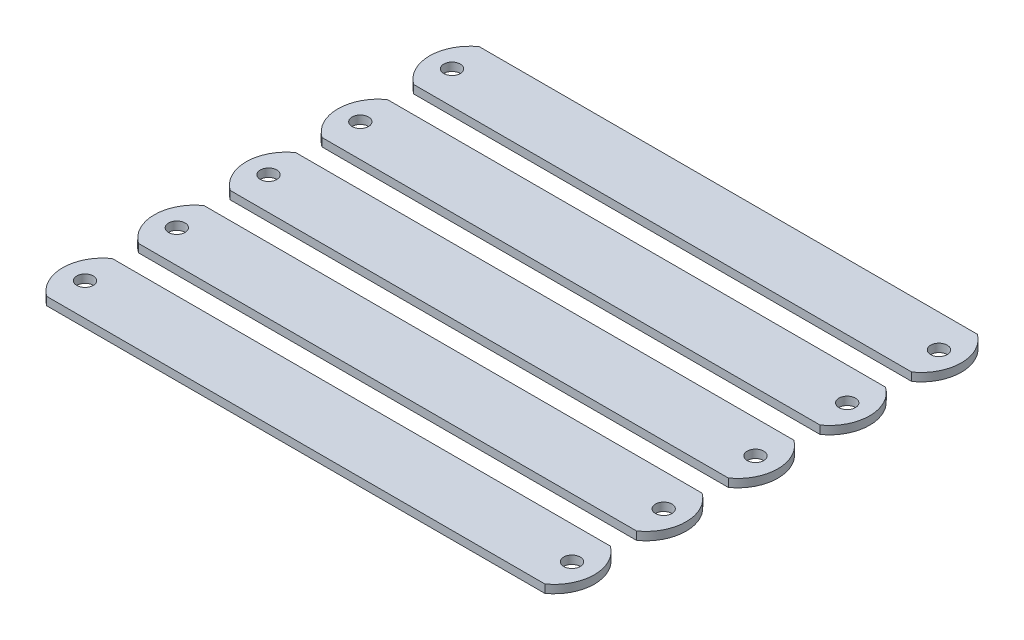
ISO-10303-21;
HEADER;
FILE_DESCRIPTION(('STEP AP214'),'2;1');
FILE_NAME('part.step','',(''),(''),'','','');
FILE_SCHEMA(('AUTOMOTIVE_DESIGN { 1 0 10303 214 1 1 1 1 }'));
ENDSEC;
DATA;
#1=APPLICATION_CONTEXT('core data for automotive mechanical design processes');
#2=APPLICATION_PROTOCOL_DEFINITION('international standard','automotive_design',2000,#1);
#3=PRODUCT_CONTEXT('',#1,'mechanical');
#4=PRODUCT('Part','Part','',(#3));
#5=PRODUCT_RELATED_PRODUCT_CATEGORY('part','',(#4));
#6=PRODUCT_DEFINITION_FORMATION('','',#4);
#7=PRODUCT_DEFINITION_CONTEXT('part definition',#1,'design');
#8=PRODUCT_DEFINITION('design','',#6,#7);
#9=PRODUCT_DEFINITION_SHAPE('','',#8);
#10=(LENGTH_UNIT() NAMED_UNIT(*) SI_UNIT(.MILLI.,.METRE.));
#11=(NAMED_UNIT(*) PLANE_ANGLE_UNIT() SI_UNIT($,.RADIAN.));
#12=(NAMED_UNIT(*) SI_UNIT($,.STERADIAN.) SOLID_ANGLE_UNIT());
#13=UNCERTAINTY_MEASURE_WITH_UNIT(LENGTH_MEASURE(1.E-05),#10,'distance_accuracy_value','');
#14=(GEOMETRIC_REPRESENTATION_CONTEXT(3) GLOBAL_UNCERTAINTY_ASSIGNED_CONTEXT((#13)) GLOBAL_UNIT_ASSIGNED_CONTEXT((#10,
#11,#12)) REPRESENTATION_CONTEXT('',''));
#15=CARTESIAN_POINT('',(0.,0.,0.));
#16=DIRECTION('',(0.,0.,1.));
#17=DIRECTION('',(1.,0.,0.));
#18=AXIS2_PLACEMENT_3D('',#15,#16,#17);
#19=CARTESIAN_POINT('',(0.,0.79375,-77.47));
#20=DIRECTION('',(0.,0.,-1.));
#21=DIRECTION('',(-1.,0.,0.));
#22=AXIS2_PLACEMENT_3D('',#19,#20,#21);
#23=PLANE('',#22);
#24=DIRECTION('',(1.,0.,0.));
#25=VECTOR('',#24,1.);
#26=CARTESIAN_POINT('',(0.,-0.79375,-77.47));
#27=LINE('',#26,#25);
#28=CARTESIAN_POINT('',(-48.26,-0.79375,-77.47));
#29=VERTEX_POINT('',#28);
#30=CARTESIAN_POINT('',(48.26,-0.79375,-77.47));
#31=VERTEX_POINT('',#30);
#32=EDGE_CURVE('E119',#29,#31,#27,.T.);
#33=ORIENTED_EDGE('',*,*,#32,.F.);
#34=DIRECTION('',(0.,-1.,0.));
#35=VECTOR('',#34,1.);
#36=CARTESIAN_POINT('',(-48.26,0.79375,-77.47));
#37=LINE('',#36,#35);
#38=CARTESIAN_POINT('',(-48.26,0.79375,-77.47));
#39=VERTEX_POINT('',#38);
#40=EDGE_CURVE('E12',#39,#29,#37,.T.);
#41=ORIENTED_EDGE('',*,*,#40,.F.);
#42=DIRECTION('',(1.,0.,0.));
#43=VECTOR('',#42,1.);
#44=CARTESIAN_POINT('',(0.,0.79375,-77.47));
#45=LINE('',#44,#43);
#46=CARTESIAN_POINT('',(48.26,0.79375,-77.47));
#47=VERTEX_POINT('',#46);
#48=EDGE_CURVE('E106',#39,#47,#45,.T.);
#49=ORIENTED_EDGE('',*,*,#48,.T.);
#50=DIRECTION('',(0.,-1.,0.));
#51=VECTOR('',#50,1.);
#52=CARTESIAN_POINT('',(48.26,0.79375,-77.47));
#53=LINE('',#52,#51);
#54=EDGE_CURVE('E63',#47,#31,#53,.T.);
#55=ORIENTED_EDGE('',*,*,#54,.T.);
#56=EDGE_LOOP('',(#33,#41,#49,#55));
#57=FACE_BOUND('',#56,.T.);
#58=ADVANCED_FACE('F46',(#57),#23,.T.);
#59=CARTESIAN_POINT('',(-43.7294932689875,0.79375,-71.12));
#60=DIRECTION('',(0.,-1.,0.));
#61=DIRECTION('',(0.,0.,-1.));
#62=AXIS2_PLACEMENT_3D('',#59,#60,#61);
#63=CYLINDRICAL_SURFACE('',#62,7.80051224213831);
#64=CARTESIAN_POINT('',(-43.7294932689875,-0.79375,-71.12));
#65=DIRECTION('',(0.,1.,0.));
#66=DIRECTION('',(0.,0.,1.));
#67=AXIS2_PLACEMENT_3D('',#64,#65,#66);
#68=CIRCLE('',#67,7.80051224213831);
#69=CARTESIAN_POINT('',(-48.26,-0.79375,-64.77));
#70=VERTEX_POINT('',#69);
#71=EDGE_CURVE('E95',#70,#29,#68,.F.);
#72=ORIENTED_EDGE('',*,*,#71,.F.);
#73=DIRECTION('',(0.,-1.,0.));
#74=VECTOR('',#73,1.);
#75=CARTESIAN_POINT('',(-48.26,0.79375,-64.77));
#76=LINE('',#75,#74);
#77=CARTESIAN_POINT('',(-48.26,0.79375,-64.77));
#78=VERTEX_POINT('',#77);
#79=EDGE_CURVE('E55',#78,#70,#76,.T.);
#80=ORIENTED_EDGE('',*,*,#79,.F.);
#81=CARTESIAN_POINT('',(-43.7294932689875,0.79375,-71.12));
#82=DIRECTION('',(0.,1.,0.));
#83=DIRECTION('',(0.,0.,1.));
#84=AXIS2_PLACEMENT_3D('',#81,#82,#83);
#85=CIRCLE('',#84,7.80051224213831);
#86=EDGE_CURVE('E93',#78,#39,#85,.F.);
#87=ORIENTED_EDGE('',*,*,#86,.T.);
#88=ORIENTED_EDGE('',*,*,#40,.T.);
#89=EDGE_LOOP('',(#72,#80,#87,#88));
#90=FACE_BOUND('',#89,.T.);
#91=ADVANCED_FACE('F91',(#90),#63,.T.);
#92=CARTESIAN_POINT('',(0.,0.79375,-64.77));
#93=DIRECTION('',(0.,0.,-1.));
#94=DIRECTION('',(-1.,0.,0.));
#95=AXIS2_PLACEMENT_3D('',#92,#93,#94);
#96=PLANE('',#95);
#97=DIRECTION('',(1.,0.,0.));
#98=VECTOR('',#97,1.);
#99=CARTESIAN_POINT('',(0.,-0.79375,-64.77));
#100=LINE('',#99,#98);
#101=CARTESIAN_POINT('',(48.26,-0.79375,-64.77));
#102=VERTEX_POINT('',#101);
#103=EDGE_CURVE('E122',#70,#102,#100,.T.);
#104=ORIENTED_EDGE('',*,*,#103,.T.);
#105=DIRECTION('',(0.,-1.,0.));
#106=VECTOR('',#105,1.);
#107=CARTESIAN_POINT('',(48.26,0.79375,-64.77));
#108=LINE('',#107,#106);
#109=CARTESIAN_POINT('',(48.26,0.79375,-64.77));
#110=VERTEX_POINT('',#109);
#111=EDGE_CURVE('E77',#110,#102,#108,.T.);
#112=ORIENTED_EDGE('',*,*,#111,.F.);
#113=DIRECTION('',(1.,0.,0.));
#114=VECTOR('',#113,1.);
#115=CARTESIAN_POINT('',(0.,0.79375,-64.77));
#116=LINE('',#115,#114);
#117=EDGE_CURVE('E98',#78,#110,#116,.T.);
#118=ORIENTED_EDGE('',*,*,#117,.F.);
#119=ORIENTED_EDGE('',*,*,#79,.T.);
#120=EDGE_LOOP('',(#104,#112,#118,#119));
#121=FACE_BOUND('',#120,.T.);
#122=ADVANCED_FACE('F99',(#121),#96,.F.);
#123=CARTESIAN_POINT('',(43.7294933208789,0.79375,-71.12));
#124=DIRECTION('',(0.,-1.,0.));
#125=DIRECTION('',(0.,0.,-1.));
#126=AXIS2_PLACEMENT_3D('',#123,#124,#125);
#127=CYLINDRICAL_SURFACE('',#126,7.800512212);
#128=CARTESIAN_POINT('',(43.7294933208789,-0.79375,-71.12));
#129=DIRECTION('',(0.,1.,0.));
#130=DIRECTION('',(0.,0.,1.));
#131=AXIS2_PLACEMENT_3D('',#128,#129,#130);
#132=CIRCLE('',#131,7.800512212);
#133=EDGE_CURVE('E124',#31,#102,#132,.F.);
#134=ORIENTED_EDGE('',*,*,#133,.F.);
#135=ORIENTED_EDGE('',*,*,#54,.F.);
#136=CARTESIAN_POINT('',(43.7294933208789,0.79375,-71.12));
#137=DIRECTION('',(0.,1.,0.));
#138=DIRECTION('',(0.,0.,1.));
#139=AXIS2_PLACEMENT_3D('',#136,#137,#138);
#140=CIRCLE('',#139,7.800512212);
#141=EDGE_CURVE('E102',#47,#110,#140,.F.);
#142=ORIENTED_EDGE('',*,*,#141,.T.);
#143=ORIENTED_EDGE('',*,*,#111,.T.);
#144=EDGE_LOOP('',(#134,#135,#142,#143));
#145=FACE_BOUND('',#144,.T.);
#146=ADVANCED_FACE('F140',(#145),#127,.T.);
#147=CARTESIAN_POINT('',(47.177105685512,0.79375,-71.12));
#148=DIRECTION('',(0.,-1.,0.));
#149=DIRECTION('',(0.,0.,-1.));
#150=AXIS2_PLACEMENT_3D('',#147,#148,#149);
#151=CYLINDRICAL_SURFACE('',#150,1.6002);
#152=CARTESIAN_POINT('',(47.177105685512,0.79375,-71.12));
#153=DIRECTION('',(0.,1.,0.));
#154=DIRECTION('',(0.,0.,1.));
#155=AXIS2_PLACEMENT_3D('',#152,#153,#154);
#156=CIRCLE('',#155,1.6002);
#157=CARTESIAN_POINT('',(47.177105685512,0.79375,-69.5198));
#158=VERTEX_POINT('',#157);
#159=EDGE_CURVE('E108',#158,#158,#156,.F.);
#160=ORIENTED_EDGE('',*,*,#159,.F.);
#161=EDGE_LOOP('',(#160));
#162=FACE_BOUND('',#161,.T.);
#163=CARTESIAN_POINT('',(47.177105685512,-0.79375,-71.12));
#164=DIRECTION('',(0.,1.,0.));
#165=DIRECTION('',(0.,0.,1.));
#166=AXIS2_PLACEMENT_3D('',#163,#164,#165);
#167=CIRCLE('',#166,1.6002);
#168=CARTESIAN_POINT('',(47.177105685512,-0.79375,-69.5198));
#169=VERTEX_POINT('',#168);
#170=EDGE_CURVE('E116',#169,#169,#167,.F.);
#171=ORIENTED_EDGE('',*,*,#170,.T.);
#172=EDGE_LOOP('',(#171));
#173=FACE_BOUND('',#172,.T.);
#174=ADVANCED_FACE('F48',(#162,#173),#151,.F.);
#175=CARTESIAN_POINT('',(-47.177105685512,0.79375,-71.12));
#176=DIRECTION('',(0.,-1.,0.));
#177=DIRECTION('',(0.,0.,-1.));
#178=AXIS2_PLACEMENT_3D('',#175,#176,#177);
#179=CYLINDRICAL_SURFACE('',#178,1.6002);
#180=CARTESIAN_POINT('',(-47.177105685512,0.79375,-71.12));
#181=DIRECTION('',(0.,1.,0.));
#182=DIRECTION('',(0.,0.,1.));
#183=AXIS2_PLACEMENT_3D('',#180,#181,#182);
#184=CIRCLE('',#183,1.6002);
#185=CARTESIAN_POINT('',(-47.177105685512,0.79375,-69.5198));
#186=VERTEX_POINT('',#185);
#187=EDGE_CURVE('E113',#186,#186,#184,.T.);
#188=ORIENTED_EDGE('',*,*,#187,.T.);
#189=EDGE_LOOP('',(#188));
#190=FACE_BOUND('',#189,.T.);
#191=CARTESIAN_POINT('',(-47.177105685512,-0.79375,-71.12));
#192=DIRECTION('',(0.,1.,0.));
#193=DIRECTION('',(0.,0.,1.));
#194=AXIS2_PLACEMENT_3D('',#191,#192,#193);
#195=CIRCLE('',#194,1.6002);
#196=CARTESIAN_POINT('',(-47.177105685512,-0.79375,-69.5198));
#197=VERTEX_POINT('',#196);
#198=EDGE_CURVE('E127',#197,#197,#195,.T.);
#199=ORIENTED_EDGE('',*,*,#198,.F.);
#200=EDGE_LOOP('',(#199));
#201=FACE_BOUND('',#200,.T.);
#202=ADVANCED_FACE('F139',(#190,#201),#179,.F.);
#203=CARTESIAN_POINT('',(0.,0.79375,-71.12));
#204=DIRECTION('',(0.,1.,0.));
#205=DIRECTION('',(0.,0.,1.));
#206=AXIS2_PLACEMENT_3D('',#203,#204,#205);
#207=PLANE('',#206);
#208=ORIENTED_EDGE('',*,*,#159,.T.);
#209=EDGE_LOOP('',(#208));
#210=FACE_BOUND('',#209,.T.);
#211=ORIENTED_EDGE('',*,*,#48,.F.);
#212=ORIENTED_EDGE('',*,*,#86,.F.);
#213=ORIENTED_EDGE('',*,*,#117,.T.);
#214=ORIENTED_EDGE('',*,*,#141,.F.);
#215=EDGE_LOOP('',(#211,#212,#213,#214));
#216=FACE_BOUND('',#215,.T.);
#217=ORIENTED_EDGE('',*,*,#187,.F.);
#218=EDGE_LOOP('',(#217));
#219=FACE_BOUND('',#218,.T.);
#220=ADVANCED_FACE('F104',(#210,#216,#219),#207,.T.);
#221=CARTESIAN_POINT('',(0.,-0.79375,-71.12));
#222=DIRECTION('',(0.,1.,0.));
#223=DIRECTION('',(0.,0.,1.));
#224=AXIS2_PLACEMENT_3D('',#221,#222,#223);
#225=PLANE('',#224);
#226=ORIENTED_EDGE('',*,*,#170,.F.);
#227=EDGE_LOOP('',(#226));
#228=FACE_BOUND('',#227,.T.);
#229=ORIENTED_EDGE('',*,*,#32,.T.);
#230=ORIENTED_EDGE('',*,*,#133,.T.);
#231=ORIENTED_EDGE('',*,*,#103,.F.);
#232=ORIENTED_EDGE('',*,*,#71,.T.);
#233=EDGE_LOOP('',(#229,#230,#231,#232));
#234=FACE_BOUND('',#233,.T.);
#235=ORIENTED_EDGE('',*,*,#198,.T.);
#236=EDGE_LOOP('',(#235));
#237=FACE_BOUND('',#236,.T.);
#238=ADVANCED_FACE('F143',(#228,#234,#237),#225,.F.);
#239=CLOSED_SHELL('',(#58,#91,#122,#146,#174,#202,#220,#238));
#240=MANIFOLD_SOLID_BREP('B2',#239);
#241=CARTESIAN_POINT('',(0.,0.79375,-59.69));
#242=DIRECTION('',(0.,0.,-1.));
#243=DIRECTION('',(-1.,0.,0.));
#244=AXIS2_PLACEMENT_3D('',#241,#242,#243);
#245=PLANE('',#244);
#246=DIRECTION('',(1.,0.,0.));
#247=VECTOR('',#246,1.);
#248=CARTESIAN_POINT('',(0.,-0.79375,-59.69));
#249=LINE('',#248,#247);
#250=CARTESIAN_POINT('',(-48.26,-0.79375,-59.69));
#251=VERTEX_POINT('',#250);
#252=CARTESIAN_POINT('',(48.26,-0.79375,-59.69));
#253=VERTEX_POINT('',#252);
#254=EDGE_CURVE('E307',#251,#253,#249,.T.);
#255=ORIENTED_EDGE('',*,*,#254,.F.);
#256=DIRECTION('',(0.,-1.,0.));
#257=VECTOR('',#256,1.);
#258=CARTESIAN_POINT('',(-48.26,0.79375,-59.69));
#259=LINE('',#258,#257);
#260=CARTESIAN_POINT('',(-48.26,0.79375,-59.69));
#261=VERTEX_POINT('',#260);
#262=EDGE_CURVE('E44',#261,#251,#259,.T.);
#263=ORIENTED_EDGE('',*,*,#262,.F.);
#264=DIRECTION('',(1.,0.,0.));
#265=VECTOR('',#264,1.);
#266=CARTESIAN_POINT('',(0.,0.79375,-59.69));
#267=LINE('',#266,#265);
#268=CARTESIAN_POINT('',(48.26,0.79375,-59.69));
#269=VERTEX_POINT('',#268);
#270=EDGE_CURVE('E294',#261,#269,#267,.T.);
#271=ORIENTED_EDGE('',*,*,#270,.T.);
#272=DIRECTION('',(0.,-1.,0.));
#273=VECTOR('',#272,1.);
#274=CARTESIAN_POINT('',(48.26,0.79375,-59.69));
#275=LINE('',#274,#273);
#276=EDGE_CURVE('E251',#269,#253,#275,.T.);
#277=ORIENTED_EDGE('',*,*,#276,.T.);
#278=EDGE_LOOP('',(#255,#263,#271,#277));
#279=FACE_BOUND('',#278,.T.);
#280=ADVANCED_FACE('F234',(#279),#245,.T.);
#281=CARTESIAN_POINT('',(-43.7294932689875,0.79375,-53.34));
#282=DIRECTION('',(0.,-1.,0.));
#283=DIRECTION('',(0.,0.,-1.));
#284=AXIS2_PLACEMENT_3D('',#281,#282,#283);
#285=CYLINDRICAL_SURFACE('',#284,7.80051224213831);
#286=CARTESIAN_POINT('',(-43.7294932689875,-0.79375,-53.34));
#287=DIRECTION('',(0.,1.,0.));
#288=DIRECTION('',(0.,0.,1.));
#289=AXIS2_PLACEMENT_3D('',#286,#287,#288);
#290=CIRCLE('',#289,7.80051224213831);
#291=CARTESIAN_POINT('',(-48.26,-0.79375,-46.99));
#292=VERTEX_POINT('',#291);
#293=EDGE_CURVE('E283',#292,#251,#290,.F.);
#294=ORIENTED_EDGE('',*,*,#293,.F.);
#295=DIRECTION('',(0.,-1.,0.));
#296=VECTOR('',#295,1.);
#297=CARTESIAN_POINT('',(-48.26,0.79375,-46.99));
#298=LINE('',#297,#296);
#299=CARTESIAN_POINT('',(-48.26,0.79375,-46.99));
#300=VERTEX_POINT('',#299);
#301=EDGE_CURVE('E243',#300,#292,#298,.T.);
#302=ORIENTED_EDGE('',*,*,#301,.F.);
#303=CARTESIAN_POINT('',(-43.7294932689875,0.79375,-53.34));
#304=DIRECTION('',(0.,1.,0.));
#305=DIRECTION('',(0.,0.,1.));
#306=AXIS2_PLACEMENT_3D('',#303,#304,#305);
#307=CIRCLE('',#306,7.80051224213831);
#308=EDGE_CURVE('E281',#300,#261,#307,.F.);
#309=ORIENTED_EDGE('',*,*,#308,.T.);
#310=ORIENTED_EDGE('',*,*,#262,.T.);
#311=EDGE_LOOP('',(#294,#302,#309,#310));
#312=FACE_BOUND('',#311,.T.);
#313=ADVANCED_FACE('F279',(#312),#285,.T.);
#314=CARTESIAN_POINT('',(0.,0.79375,-46.99));
#315=DIRECTION('',(0.,0.,-1.));
#316=DIRECTION('',(-1.,0.,0.));
#317=AXIS2_PLACEMENT_3D('',#314,#315,#316);
#318=PLANE('',#317);
#319=DIRECTION('',(1.,0.,0.));
#320=VECTOR('',#319,1.);
#321=CARTESIAN_POINT('',(0.,-0.79375,-46.99));
#322=LINE('',#321,#320);
#323=CARTESIAN_POINT('',(48.26,-0.79375,-46.99));
#324=VERTEX_POINT('',#323);
#325=EDGE_CURVE('E310',#292,#324,#322,.T.);
#326=ORIENTED_EDGE('',*,*,#325,.T.);
#327=DIRECTION('',(0.,-1.,0.));
#328=VECTOR('',#327,1.);
#329=CARTESIAN_POINT('',(48.26,0.79375,-46.99));
#330=LINE('',#329,#328);
#331=CARTESIAN_POINT('',(48.26,0.79375,-46.99));
#332=VERTEX_POINT('',#331);
#333=EDGE_CURVE('E265',#332,#324,#330,.T.);
#334=ORIENTED_EDGE('',*,*,#333,.F.);
#335=DIRECTION('',(1.,0.,0.));
#336=VECTOR('',#335,1.);
#337=CARTESIAN_POINT('',(0.,0.79375,-46.99));
#338=LINE('',#337,#336);
#339=EDGE_CURVE('E286',#300,#332,#338,.T.);
#340=ORIENTED_EDGE('',*,*,#339,.F.);
#341=ORIENTED_EDGE('',*,*,#301,.T.);
#342=EDGE_LOOP('',(#326,#334,#340,#341));
#343=FACE_BOUND('',#342,.T.);
#344=ADVANCED_FACE('F287',(#343),#318,.F.);
#345=CARTESIAN_POINT('',(43.7294933208789,0.79375,-53.34));
#346=DIRECTION('',(0.,-1.,0.));
#347=DIRECTION('',(0.,0.,-1.));
#348=AXIS2_PLACEMENT_3D('',#345,#346,#347);
#349=CYLINDRICAL_SURFACE('',#348,7.800512212);
#350=CARTESIAN_POINT('',(43.7294933208789,-0.79375,-53.34));
#351=DIRECTION('',(0.,1.,0.));
#352=DIRECTION('',(0.,0.,1.));
#353=AXIS2_PLACEMENT_3D('',#350,#351,#352);
#354=CIRCLE('',#353,7.800512212);
#355=EDGE_CURVE('E312',#253,#324,#354,.F.);
#356=ORIENTED_EDGE('',*,*,#355,.F.);
#357=ORIENTED_EDGE('',*,*,#276,.F.);
#358=CARTESIAN_POINT('',(43.7294933208789,0.79375,-53.34));
#359=DIRECTION('',(0.,1.,0.));
#360=DIRECTION('',(0.,0.,1.));
#361=AXIS2_PLACEMENT_3D('',#358,#359,#360);
#362=CIRCLE('',#361,7.800512212);
#363=EDGE_CURVE('E290',#269,#332,#362,.F.);
#364=ORIENTED_EDGE('',*,*,#363,.T.);
#365=ORIENTED_EDGE('',*,*,#333,.T.);
#366=EDGE_LOOP('',(#356,#357,#364,#365));
#367=FACE_BOUND('',#366,.T.);
#368=ADVANCED_FACE('F328',(#367),#349,.T.);
#369=CARTESIAN_POINT('',(47.177105685512,0.79375,-53.34));
#370=DIRECTION('',(0.,-1.,0.));
#371=DIRECTION('',(0.,0.,-1.));
#372=AXIS2_PLACEMENT_3D('',#369,#370,#371);
#373=CYLINDRICAL_SURFACE('',#372,1.6002);
#374=CARTESIAN_POINT('',(47.177105685512,0.79375,-53.34));
#375=DIRECTION('',(0.,1.,0.));
#376=DIRECTION('',(0.,0.,1.));
#377=AXIS2_PLACEMENT_3D('',#374,#375,#376);
#378=CIRCLE('',#377,1.6002);
#379=CARTESIAN_POINT('',(47.177105685512,0.79375,-51.7398));
#380=VERTEX_POINT('',#379);
#381=EDGE_CURVE('E296',#380,#380,#378,.F.);
#382=ORIENTED_EDGE('',*,*,#381,.F.);
#383=EDGE_LOOP('',(#382));
#384=FACE_BOUND('',#383,.T.);
#385=CARTESIAN_POINT('',(47.177105685512,-0.79375,-53.34));
#386=DIRECTION('',(0.,1.,0.));
#387=DIRECTION('',(0.,0.,1.));
#388=AXIS2_PLACEMENT_3D('',#385,#386,#387);
#389=CIRCLE('',#388,1.6002);
#390=CARTESIAN_POINT('',(47.177105685512,-0.79375,-51.7398));
#391=VERTEX_POINT('',#390);
#392=EDGE_CURVE('E304',#391,#391,#389,.F.);
#393=ORIENTED_EDGE('',*,*,#392,.T.);
#394=EDGE_LOOP('',(#393));
#395=FACE_BOUND('',#394,.T.);
#396=ADVANCED_FACE('F236',(#384,#395),#373,.F.);
#397=CARTESIAN_POINT('',(-47.177105685512,0.79375,-53.34));
#398=DIRECTION('',(0.,-1.,0.));
#399=DIRECTION('',(0.,0.,-1.));
#400=AXIS2_PLACEMENT_3D('',#397,#398,#399);
#401=CYLINDRICAL_SURFACE('',#400,1.6002);
#402=CARTESIAN_POINT('',(-47.177105685512,0.79375,-53.34));
#403=DIRECTION('',(0.,1.,0.));
#404=DIRECTION('',(0.,0.,1.));
#405=AXIS2_PLACEMENT_3D('',#402,#403,#404);
#406=CIRCLE('',#405,1.6002);
#407=CARTESIAN_POINT('',(-47.177105685512,0.79375,-51.7398));
#408=VERTEX_POINT('',#407);
#409=EDGE_CURVE('E301',#408,#408,#406,.T.);
#410=ORIENTED_EDGE('',*,*,#409,.T.);
#411=EDGE_LOOP('',(#410));
#412=FACE_BOUND('',#411,.T.);
#413=CARTESIAN_POINT('',(-47.177105685512,-0.79375,-53.34));
#414=DIRECTION('',(0.,1.,0.));
#415=DIRECTION('',(0.,0.,1.));
#416=AXIS2_PLACEMENT_3D('',#413,#414,#415);
#417=CIRCLE('',#416,1.6002);
#418=CARTESIAN_POINT('',(-47.177105685512,-0.79375,-51.7398));
#419=VERTEX_POINT('',#418);
#420=EDGE_CURVE('E315',#419,#419,#417,.T.);
#421=ORIENTED_EDGE('',*,*,#420,.F.);
#422=EDGE_LOOP('',(#421));
#423=FACE_BOUND('',#422,.T.);
#424=ADVANCED_FACE('F327',(#412,#423),#401,.F.);
#425=CARTESIAN_POINT('',(0.,0.79375,-53.34));
#426=DIRECTION('',(0.,1.,0.));
#427=DIRECTION('',(0.,0.,1.));
#428=AXIS2_PLACEMENT_3D('',#425,#426,#427);
#429=PLANE('',#428);
#430=ORIENTED_EDGE('',*,*,#381,.T.);
#431=EDGE_LOOP('',(#430));
#432=FACE_BOUND('',#431,.T.);
#433=ORIENTED_EDGE('',*,*,#270,.F.);
#434=ORIENTED_EDGE('',*,*,#308,.F.);
#435=ORIENTED_EDGE('',*,*,#339,.T.);
#436=ORIENTED_EDGE('',*,*,#363,.F.);
#437=EDGE_LOOP('',(#433,#434,#435,#436));
#438=FACE_BOUND('',#437,.T.);
#439=ORIENTED_EDGE('',*,*,#409,.F.);
#440=EDGE_LOOP('',(#439));
#441=FACE_BOUND('',#440,.T.);
#442=ADVANCED_FACE('F292',(#432,#438,#441),#429,.T.);
#443=CARTESIAN_POINT('',(0.,-0.79375,-53.34));
#444=DIRECTION('',(0.,1.,0.));
#445=DIRECTION('',(0.,0.,1.));
#446=AXIS2_PLACEMENT_3D('',#443,#444,#445);
#447=PLANE('',#446);
#448=ORIENTED_EDGE('',*,*,#392,.F.);
#449=EDGE_LOOP('',(#448));
#450=FACE_BOUND('',#449,.T.);
#451=ORIENTED_EDGE('',*,*,#254,.T.);
#452=ORIENTED_EDGE('',*,*,#355,.T.);
#453=ORIENTED_EDGE('',*,*,#325,.F.);
#454=ORIENTED_EDGE('',*,*,#293,.T.);
#455=EDGE_LOOP('',(#451,#452,#453,#454));
#456=FACE_BOUND('',#455,.T.);
#457=ORIENTED_EDGE('',*,*,#420,.T.);
#458=EDGE_LOOP('',(#457));
#459=FACE_BOUND('',#458,.T.);
#460=ADVANCED_FACE('F331',(#450,#456,#459),#447,.F.);
#461=CLOSED_SHELL('',(#280,#313,#344,#368,#396,#424,#442,#460));
#462=MANIFOLD_SOLID_BREP('B6',#461);
#463=CARTESIAN_POINT('',(0.,0.79375,-41.91));
#464=DIRECTION('',(0.,0.,-1.));
#465=DIRECTION('',(-1.,0.,0.));
#466=AXIS2_PLACEMENT_3D('',#463,#464,#465);
#467=PLANE('',#466);
#468=DIRECTION('',(1.,0.,0.));
#469=VECTOR('',#468,1.);
#470=CARTESIAN_POINT('',(0.,-0.79375,-41.91));
#471=LINE('',#470,#469);
#472=CARTESIAN_POINT('',(-48.26,-0.79375,-41.91));
#473=VERTEX_POINT('',#472);
#474=CARTESIAN_POINT('',(48.26,-0.79375,-41.91));
#475=VERTEX_POINT('',#474);
#476=EDGE_CURVE('E495',#473,#475,#471,.T.);
#477=ORIENTED_EDGE('',*,*,#476,.F.);
#478=DIRECTION('',(0.,-1.,0.));
#479=VECTOR('',#478,1.);
#480=CARTESIAN_POINT('',(-48.26,0.79375,-41.91));
#481=LINE('',#480,#479);
#482=CARTESIAN_POINT('',(-48.26,0.79375,-41.91));
#483=VERTEX_POINT('',#482);
#484=EDGE_CURVE('E232',#483,#473,#481,.T.);
#485=ORIENTED_EDGE('',*,*,#484,.F.);
#486=DIRECTION('',(1.,0.,0.));
#487=VECTOR('',#486,1.);
#488=CARTESIAN_POINT('',(0.,0.79375,-41.91));
#489=LINE('',#488,#487);
#490=CARTESIAN_POINT('',(48.26,0.79375,-41.91));
#491=VERTEX_POINT('',#490);
#492=EDGE_CURVE('E482',#483,#491,#489,.T.);
#493=ORIENTED_EDGE('',*,*,#492,.T.);
#494=DIRECTION('',(0.,-1.,0.));
#495=VECTOR('',#494,1.);
#496=CARTESIAN_POINT('',(48.26,0.79375,-41.91));
#497=LINE('',#496,#495);
#498=EDGE_CURVE('E439',#491,#475,#497,.T.);
#499=ORIENTED_EDGE('',*,*,#498,.T.);
#500=EDGE_LOOP('',(#477,#485,#493,#499));
#501=FACE_BOUND('',#500,.T.);
#502=ADVANCED_FACE('F422',(#501),#467,.T.);
#503=CARTESIAN_POINT('',(-43.7294932689875,0.79375,-35.56));
#504=DIRECTION('',(0.,-1.,0.));
#505=DIRECTION('',(0.,0.,-1.));
#506=AXIS2_PLACEMENT_3D('',#503,#504,#505);
#507=CYLINDRICAL_SURFACE('',#506,7.80051224213831);
#508=CARTESIAN_POINT('',(-43.7294932689875,-0.79375,-35.56));
#509=DIRECTION('',(0.,1.,0.));
#510=DIRECTION('',(0.,0.,1.));
#511=AXIS2_PLACEMENT_3D('',#508,#509,#510);
#512=CIRCLE('',#511,7.80051224213831);
#513=CARTESIAN_POINT('',(-48.26,-0.79375,-29.21));
#514=VERTEX_POINT('',#513);
#515=EDGE_CURVE('E471',#514,#473,#512,.F.);
#516=ORIENTED_EDGE('',*,*,#515,.F.);
#517=DIRECTION('',(0.,-1.,0.));
#518=VECTOR('',#517,1.);
#519=CARTESIAN_POINT('',(-48.26,0.79375,-29.21));
#520=LINE('',#519,#518);
#521=CARTESIAN_POINT('',(-48.26,0.79375,-29.21));
#522=VERTEX_POINT('',#521);
#523=EDGE_CURVE('E431',#522,#514,#520,.T.);
#524=ORIENTED_EDGE('',*,*,#523,.F.);
#525=CARTESIAN_POINT('',(-43.7294932689875,0.79375,-35.56));
#526=DIRECTION('',(0.,1.,0.));
#527=DIRECTION('',(0.,0.,1.));
#528=AXIS2_PLACEMENT_3D('',#525,#526,#527);
#529=CIRCLE('',#528,7.80051224213831);
#530=EDGE_CURVE('E469',#522,#483,#529,.F.);
#531=ORIENTED_EDGE('',*,*,#530,.T.);
#532=ORIENTED_EDGE('',*,*,#484,.T.);
#533=EDGE_LOOP('',(#516,#524,#531,#532));
#534=FACE_BOUND('',#533,.T.);
#535=ADVANCED_FACE('F467',(#534),#507,.T.);
#536=CARTESIAN_POINT('',(0.,0.79375,-29.21));
#537=DIRECTION('',(0.,0.,-1.));
#538=DIRECTION('',(-1.,0.,0.));
#539=AXIS2_PLACEMENT_3D('',#536,#537,#538);
#540=PLANE('',#539);
#541=DIRECTION('',(1.,0.,0.));
#542=VECTOR('',#541,1.);
#543=CARTESIAN_POINT('',(0.,-0.79375,-29.21));
#544=LINE('',#543,#542);
#545=CARTESIAN_POINT('',(48.26,-0.79375,-29.21));
#546=VERTEX_POINT('',#545);
#547=EDGE_CURVE('E498',#514,#546,#544,.T.);
#548=ORIENTED_EDGE('',*,*,#547,.T.);
#549=DIRECTION('',(0.,-1.,0.));
#550=VECTOR('',#549,1.);
#551=CARTESIAN_POINT('',(48.26,0.79375,-29.21));
#552=LINE('',#551,#550);
#553=CARTESIAN_POINT('',(48.26,0.79375,-29.21));
#554=VERTEX_POINT('',#553);
#555=EDGE_CURVE('E453',#554,#546,#552,.T.);
#556=ORIENTED_EDGE('',*,*,#555,.F.);
#557=DIRECTION('',(1.,0.,0.));
#558=VECTOR('',#557,1.);
#559=CARTESIAN_POINT('',(0.,0.79375,-29.21));
#560=LINE('',#559,#558);
#561=EDGE_CURVE('E474',#522,#554,#560,.T.);
#562=ORIENTED_EDGE('',*,*,#561,.F.);
#563=ORIENTED_EDGE('',*,*,#523,.T.);
#564=EDGE_LOOP('',(#548,#556,#562,#563));
#565=FACE_BOUND('',#564,.T.);
#566=ADVANCED_FACE('F475',(#565),#540,.F.);
#567=CARTESIAN_POINT('',(43.7294933208789,0.79375,-35.56));
#568=DIRECTION('',(0.,-1.,0.));
#569=DIRECTION('',(0.,0.,-1.));
#570=AXIS2_PLACEMENT_3D('',#567,#568,#569);
#571=CYLINDRICAL_SURFACE('',#570,7.800512212);
#572=CARTESIAN_POINT('',(43.7294933208789,-0.79375,-35.56));
#573=DIRECTION('',(0.,1.,0.));
#574=DIRECTION('',(0.,0.,1.));
#575=AXIS2_PLACEMENT_3D('',#572,#573,#574);
#576=CIRCLE('',#575,7.800512212);
#577=EDGE_CURVE('E500',#475,#546,#576,.F.);
#578=ORIENTED_EDGE('',*,*,#577,.F.);
#579=ORIENTED_EDGE('',*,*,#498,.F.);
#580=CARTESIAN_POINT('',(43.7294933208789,0.79375,-35.56));
#581=DIRECTION('',(0.,1.,0.));
#582=DIRECTION('',(0.,0.,1.));
#583=AXIS2_PLACEMENT_3D('',#580,#581,#582);
#584=CIRCLE('',#583,7.800512212);
#585=EDGE_CURVE('E478',#491,#554,#584,.F.);
#586=ORIENTED_EDGE('',*,*,#585,.T.);
#587=ORIENTED_EDGE('',*,*,#555,.T.);
#588=EDGE_LOOP('',(#578,#579,#586,#587));
#589=FACE_BOUND('',#588,.T.);
#590=ADVANCED_FACE('F516',(#589),#571,.T.);
#591=CARTESIAN_POINT('',(47.177105685512,0.79375,-35.56));
#592=DIRECTION('',(0.,-1.,0.));
#593=DIRECTION('',(0.,0.,-1.));
#594=AXIS2_PLACEMENT_3D('',#591,#592,#593);
#595=CYLINDRICAL_SURFACE('',#594,1.6002);
#596=CARTESIAN_POINT('',(47.177105685512,0.79375,-35.56));
#597=DIRECTION('',(0.,1.,0.));
#598=DIRECTION('',(0.,0.,1.));
#599=AXIS2_PLACEMENT_3D('',#596,#597,#598);
#600=CIRCLE('',#599,1.6002);
#601=CARTESIAN_POINT('',(47.177105685512,0.79375,-33.9598));
#602=VERTEX_POINT('',#601);
#603=EDGE_CURVE('E484',#602,#602,#600,.F.);
#604=ORIENTED_EDGE('',*,*,#603,.F.);
#605=EDGE_LOOP('',(#604));
#606=FACE_BOUND('',#605,.T.);
#607=CARTESIAN_POINT('',(47.177105685512,-0.79375,-35.56));
#608=DIRECTION('',(0.,1.,0.));
#609=DIRECTION('',(0.,0.,1.));
#610=AXIS2_PLACEMENT_3D('',#607,#608,#609);
#611=CIRCLE('',#610,1.6002);
#612=CARTESIAN_POINT('',(47.177105685512,-0.79375,-33.9598));
#613=VERTEX_POINT('',#612);
#614=EDGE_CURVE('E492',#613,#613,#611,.F.);
#615=ORIENTED_EDGE('',*,*,#614,.T.);
#616=EDGE_LOOP('',(#615));
#617=FACE_BOUND('',#616,.T.);
#618=ADVANCED_FACE('F424',(#606,#617),#595,.F.);
#619=CARTESIAN_POINT('',(-47.177105685512,0.79375,-35.56));
#620=DIRECTION('',(0.,-1.,0.));
#621=DIRECTION('',(0.,0.,-1.));
#622=AXIS2_PLACEMENT_3D('',#619,#620,#621);
#623=CYLINDRICAL_SURFACE('',#622,1.6002);
#624=CARTESIAN_POINT('',(-47.177105685512,0.79375,-35.56));
#625=DIRECTION('',(0.,1.,0.));
#626=DIRECTION('',(0.,0.,1.));
#627=AXIS2_PLACEMENT_3D('',#624,#625,#626);
#628=CIRCLE('',#627,1.6002);
#629=CARTESIAN_POINT('',(-47.177105685512,0.79375,-33.9598));
#630=VERTEX_POINT('',#629);
#631=EDGE_CURVE('E489',#630,#630,#628,.T.);
#632=ORIENTED_EDGE('',*,*,#631,.T.);
#633=EDGE_LOOP('',(#632));
#634=FACE_BOUND('',#633,.T.);
#635=CARTESIAN_POINT('',(-47.177105685512,-0.79375,-35.56));
#636=DIRECTION('',(0.,1.,0.));
#637=DIRECTION('',(0.,0.,1.));
#638=AXIS2_PLACEMENT_3D('',#635,#636,#637);
#639=CIRCLE('',#638,1.6002);
#640=CARTESIAN_POINT('',(-47.177105685512,-0.79375,-33.9598));
#641=VERTEX_POINT('',#640);
#642=EDGE_CURVE('E503',#641,#641,#639,.T.);
#643=ORIENTED_EDGE('',*,*,#642,.F.);
#644=EDGE_LOOP('',(#643));
#645=FACE_BOUND('',#644,.T.);
#646=ADVANCED_FACE('F515',(#634,#645),#623,.F.);
#647=CARTESIAN_POINT('',(0.,0.79375,-35.56));
#648=DIRECTION('',(0.,1.,0.));
#649=DIRECTION('',(0.,0.,1.));
#650=AXIS2_PLACEMENT_3D('',#647,#648,#649);
#651=PLANE('',#650);
#652=ORIENTED_EDGE('',*,*,#603,.T.);
#653=EDGE_LOOP('',(#652));
#654=FACE_BOUND('',#653,.T.);
#655=ORIENTED_EDGE('',*,*,#492,.F.);
#656=ORIENTED_EDGE('',*,*,#530,.F.);
#657=ORIENTED_EDGE('',*,*,#561,.T.);
#658=ORIENTED_EDGE('',*,*,#585,.F.);
#659=EDGE_LOOP('',(#655,#656,#657,#658));
#660=FACE_BOUND('',#659,.T.);
#661=ORIENTED_EDGE('',*,*,#631,.F.);
#662=EDGE_LOOP('',(#661));
#663=FACE_BOUND('',#662,.T.);
#664=ADVANCED_FACE('F480',(#654,#660,#663),#651,.T.);
#665=CARTESIAN_POINT('',(0.,-0.79375,-35.56));
#666=DIRECTION('',(0.,1.,0.));
#667=DIRECTION('',(0.,0.,1.));
#668=AXIS2_PLACEMENT_3D('',#665,#666,#667);
#669=PLANE('',#668);
#670=ORIENTED_EDGE('',*,*,#614,.F.);
#671=EDGE_LOOP('',(#670));
#672=FACE_BOUND('',#671,.T.);
#673=ORIENTED_EDGE('',*,*,#476,.T.);
#674=ORIENTED_EDGE('',*,*,#577,.T.);
#675=ORIENTED_EDGE('',*,*,#547,.F.);
#676=ORIENTED_EDGE('',*,*,#515,.T.);
#677=EDGE_LOOP('',(#673,#674,#675,#676));
#678=FACE_BOUND('',#677,.T.);
#679=ORIENTED_EDGE('',*,*,#642,.T.);
#680=EDGE_LOOP('',(#679));
#681=FACE_BOUND('',#680,.T.);
#682=ADVANCED_FACE('F519',(#672,#678,#681),#669,.F.);
#683=CLOSED_SHELL('',(#502,#535,#566,#590,#618,#646,#664,#682));
#684=MANIFOLD_SOLID_BREP('B38',#683);
#685=CARTESIAN_POINT('',(0.,0.79375,-24.13));
#686=DIRECTION('',(0.,0.,-1.));
#687=DIRECTION('',(-1.,0.,0.));
#688=AXIS2_PLACEMENT_3D('',#685,#686,#687);
#689=PLANE('',#688);
#690=DIRECTION('',(1.,0.,0.));
#691=VECTOR('',#690,1.);
#692=CARTESIAN_POINT('',(0.,-0.79375,-24.13));
#693=LINE('',#692,#691);
#694=CARTESIAN_POINT('',(-48.26,-0.79375,-24.13));
#695=VERTEX_POINT('',#694);
#696=CARTESIAN_POINT('',(48.26,-0.79375,-24.13));
#697=VERTEX_POINT('',#696);
#698=EDGE_CURVE('E682',#695,#697,#693,.T.);
#699=ORIENTED_EDGE('',*,*,#698,.F.);
#700=DIRECTION('',(0.,-1.,0.));
#701=VECTOR('',#700,1.);
#702=CARTESIAN_POINT('',(-48.26,0.79375,-24.13));
#703=LINE('',#702,#701);
#704=CARTESIAN_POINT('',(-48.26,0.79375,-24.13));
#705=VERTEX_POINT('',#704);
#706=EDGE_CURVE('E420',#705,#695,#703,.T.);
#707=ORIENTED_EDGE('',*,*,#706,.F.);
#708=DIRECTION('',(1.,0.,0.));
#709=VECTOR('',#708,1.);
#710=CARTESIAN_POINT('',(0.,0.79375,-24.13));
#711=LINE('',#710,#709);
#712=CARTESIAN_POINT('',(48.26,0.79375,-24.13));
#713=VERTEX_POINT('',#712);
#714=EDGE_CURVE('E669',#705,#713,#711,.T.);
#715=ORIENTED_EDGE('',*,*,#714,.T.);
#716=DIRECTION('',(0.,-1.,0.));
#717=VECTOR('',#716,1.);
#718=CARTESIAN_POINT('',(48.26,0.79375,-24.13));
#719=LINE('',#718,#717);
#720=EDGE_CURVE('E626',#713,#697,#719,.T.);
#721=ORIENTED_EDGE('',*,*,#720,.T.);
#722=EDGE_LOOP('',(#699,#707,#715,#721));
#723=FACE_BOUND('',#722,.T.);
#724=ADVANCED_FACE('F609',(#723),#689,.T.);
#725=CARTESIAN_POINT('',(-43.7294932689875,0.79375,-17.78));
#726=DIRECTION('',(0.,-1.,0.));
#727=DIRECTION('',(0.,0.,-1.));
#728=AXIS2_PLACEMENT_3D('',#725,#726,#727);
#729=CYLINDRICAL_SURFACE('',#728,7.80051224213831);
#730=CARTESIAN_POINT('',(-43.7294932689875,-0.79375,-17.78));
#731=DIRECTION('',(0.,1.,0.));
#732=DIRECTION('',(0.,0.,1.));
#733=AXIS2_PLACEMENT_3D('',#730,#731,#732);
#734=CIRCLE('',#733,7.80051224213831);
#735=CARTESIAN_POINT('',(-48.26,-0.79375,-11.43));
#736=VERTEX_POINT('',#735);
#737=EDGE_CURVE('E658',#736,#695,#734,.F.);
#738=ORIENTED_EDGE('',*,*,#737,.F.);
#739=DIRECTION('',(0.,-1.,0.));
#740=VECTOR('',#739,1.);
#741=CARTESIAN_POINT('',(-48.26,0.79375,-11.43));
#742=LINE('',#741,#740);
#743=CARTESIAN_POINT('',(-48.26,0.79375,-11.43));
#744=VERTEX_POINT('',#743);
#745=EDGE_CURVE('E618',#744,#736,#742,.T.);
#746=ORIENTED_EDGE('',*,*,#745,.F.);
#747=CARTESIAN_POINT('',(-43.7294932689875,0.79375,-17.78));
#748=DIRECTION('',(0.,1.,0.));
#749=DIRECTION('',(0.,0.,1.));
#750=AXIS2_PLACEMENT_3D('',#747,#748,#749);
#751=CIRCLE('',#750,7.80051224213831);
#752=EDGE_CURVE('E656',#744,#705,#751,.F.);
#753=ORIENTED_EDGE('',*,*,#752,.T.);
#754=ORIENTED_EDGE('',*,*,#706,.T.);
#755=EDGE_LOOP('',(#738,#746,#753,#754));
#756=FACE_BOUND('',#755,.T.);
#757=ADVANCED_FACE('F654',(#756),#729,.T.);
#758=CARTESIAN_POINT('',(0.,0.79375,-11.43));
#759=DIRECTION('',(0.,0.,-1.));
#760=DIRECTION('',(-1.,0.,0.));
#761=AXIS2_PLACEMENT_3D('',#758,#759,#760);
#762=PLANE('',#761);
#763=DIRECTION('',(1.,0.,0.));
#764=VECTOR('',#763,1.);
#765=CARTESIAN_POINT('',(0.,-0.79375,-11.43));
#766=LINE('',#765,#764);
#767=CARTESIAN_POINT('',(48.26,-0.79375,-11.43));
#768=VERTEX_POINT('',#767);
#769=EDGE_CURVE('E685',#736,#768,#766,.T.);
#770=ORIENTED_EDGE('',*,*,#769,.T.);
#771=DIRECTION('',(0.,-1.,0.));
#772=VECTOR('',#771,1.);
#773=CARTESIAN_POINT('',(48.26,0.79375,-11.43));
#774=LINE('',#773,#772);
#775=CARTESIAN_POINT('',(48.26,0.79375,-11.43));
#776=VERTEX_POINT('',#775);
#777=EDGE_CURVE('E640',#776,#768,#774,.T.);
#778=ORIENTED_EDGE('',*,*,#777,.F.);
#779=DIRECTION('',(1.,0.,0.));
#780=VECTOR('',#779,1.);
#781=CARTESIAN_POINT('',(0.,0.79375,-11.43));
#782=LINE('',#781,#780);
#783=EDGE_CURVE('E661',#744,#776,#782,.T.);
#784=ORIENTED_EDGE('',*,*,#783,.F.);
#785=ORIENTED_EDGE('',*,*,#745,.T.);
#786=EDGE_LOOP('',(#770,#778,#784,#785));
#787=FACE_BOUND('',#786,.T.);
#788=ADVANCED_FACE('F662',(#787),#762,.F.);
#789=CARTESIAN_POINT('',(43.7294933208789,0.79375,-17.78));
#790=DIRECTION('',(0.,-1.,0.));
#791=DIRECTION('',(0.,0.,-1.));
#792=AXIS2_PLACEMENT_3D('',#789,#790,#791);
#793=CYLINDRICAL_SURFACE('',#792,7.800512212);
#794=CARTESIAN_POINT('',(43.7294933208789,-0.79375,-17.78));
#795=DIRECTION('',(0.,1.,0.));
#796=DIRECTION('',(0.,0.,1.));
#797=AXIS2_PLACEMENT_3D('',#794,#795,#796);
#798=CIRCLE('',#797,7.800512212);
#799=EDGE_CURVE('E687',#697,#768,#798,.F.);
#800=ORIENTED_EDGE('',*,*,#799,.F.);
#801=ORIENTED_EDGE('',*,*,#720,.F.);
#802=CARTESIAN_POINT('',(43.7294933208789,0.79375,-17.78));
#803=DIRECTION('',(0.,1.,0.));
#804=DIRECTION('',(0.,0.,1.));
#805=AXIS2_PLACEMENT_3D('',#802,#803,#804);
#806=CIRCLE('',#805,7.800512212);
#807=EDGE_CURVE('E665',#713,#776,#806,.F.);
#808=ORIENTED_EDGE('',*,*,#807,.T.);
#809=ORIENTED_EDGE('',*,*,#777,.T.);
#810=EDGE_LOOP('',(#800,#801,#808,#809));
#811=FACE_BOUND('',#810,.T.);
#812=ADVANCED_FACE('F703',(#811),#793,.T.);
#813=CARTESIAN_POINT('',(47.177105685512,0.79375,-17.78));
#814=DIRECTION('',(0.,-1.,0.));
#815=DIRECTION('',(0.,0.,-1.));
#816=AXIS2_PLACEMENT_3D('',#813,#814,#815);
#817=CYLINDRICAL_SURFACE('',#816,1.6002);
#818=CARTESIAN_POINT('',(47.177105685512,0.79375,-17.78));
#819=DIRECTION('',(0.,1.,0.));
#820=DIRECTION('',(0.,0.,1.));
#821=AXIS2_PLACEMENT_3D('',#818,#819,#820);
#822=CIRCLE('',#821,1.6002);
#823=CARTESIAN_POINT('',(47.177105685512,0.79375,-16.1798));
#824=VERTEX_POINT('',#823);
#825=EDGE_CURVE('E671',#824,#824,#822,.F.);
#826=ORIENTED_EDGE('',*,*,#825,.F.);
#827=EDGE_LOOP('',(#826));
#828=FACE_BOUND('',#827,.T.);
#829=CARTESIAN_POINT('',(47.177105685512,-0.79375,-17.78));
#830=DIRECTION('',(0.,1.,0.));
#831=DIRECTION('',(0.,0.,1.));
#832=AXIS2_PLACEMENT_3D('',#829,#830,#831);
#833=CIRCLE('',#832,1.6002);
#834=CARTESIAN_POINT('',(47.177105685512,-0.79375,-16.1798));
#835=VERTEX_POINT('',#834);
#836=EDGE_CURVE('E679',#835,#835,#833,.F.);
#837=ORIENTED_EDGE('',*,*,#836,.T.);
#838=EDGE_LOOP('',(#837));
#839=FACE_BOUND('',#838,.T.);
#840=ADVANCED_FACE('F611',(#828,#839),#817,.F.);
#841=CARTESIAN_POINT('',(-47.177105685512,0.79375,-17.78));
#842=DIRECTION('',(0.,-1.,0.));
#843=DIRECTION('',(0.,0.,-1.));
#844=AXIS2_PLACEMENT_3D('',#841,#842,#843);
#845=CYLINDRICAL_SURFACE('',#844,1.6002);
#846=CARTESIAN_POINT('',(-47.177105685512,0.79375,-17.78));
#847=DIRECTION('',(0.,1.,0.));
#848=DIRECTION('',(0.,0.,1.));
#849=AXIS2_PLACEMENT_3D('',#846,#847,#848);
#850=CIRCLE('',#849,1.6002);
#851=CARTESIAN_POINT('',(-47.177105685512,0.79375,-16.1798));
#852=VERTEX_POINT('',#851);
#853=EDGE_CURVE('E676',#852,#852,#850,.T.);
#854=ORIENTED_EDGE('',*,*,#853,.T.);
#855=EDGE_LOOP('',(#854));
#856=FACE_BOUND('',#855,.T.);
#857=CARTESIAN_POINT('',(-47.177105685512,-0.79375,-17.78));
#858=DIRECTION('',(0.,1.,0.));
#859=DIRECTION('',(0.,0.,1.));
#860=AXIS2_PLACEMENT_3D('',#857,#858,#859);
#861=CIRCLE('',#860,1.6002);
#862=CARTESIAN_POINT('',(-47.177105685512,-0.79375,-16.1798));
#863=VERTEX_POINT('',#862);
#864=EDGE_CURVE('E690',#863,#863,#861,.T.);
#865=ORIENTED_EDGE('',*,*,#864,.F.);
#866=EDGE_LOOP('',(#865));
#867=FACE_BOUND('',#866,.T.);
#868=ADVANCED_FACE('F702',(#856,#867),#845,.F.);
#869=CARTESIAN_POINT('',(0.,0.79375,-17.78));
#870=DIRECTION('',(0.,1.,0.));
#871=DIRECTION('',(0.,0.,1.));
#872=AXIS2_PLACEMENT_3D('',#869,#870,#871);
#873=PLANE('',#872);
#874=ORIENTED_EDGE('',*,*,#825,.T.);
#875=EDGE_LOOP('',(#874));
#876=FACE_BOUND('',#875,.T.);
#877=ORIENTED_EDGE('',*,*,#714,.F.);
#878=ORIENTED_EDGE('',*,*,#752,.F.);
#879=ORIENTED_EDGE('',*,*,#783,.T.);
#880=ORIENTED_EDGE('',*,*,#807,.F.);
#881=EDGE_LOOP('',(#877,#878,#879,#880));
#882=FACE_BOUND('',#881,.T.);
#883=ORIENTED_EDGE('',*,*,#853,.F.);
#884=EDGE_LOOP('',(#883));
#885=FACE_BOUND('',#884,.T.);
#886=ADVANCED_FACE('F667',(#876,#882,#885),#873,.T.);
#887=CARTESIAN_POINT('',(0.,-0.79375,-17.78));
#888=DIRECTION('',(0.,1.,0.));
#889=DIRECTION('',(0.,0.,1.));
#890=AXIS2_PLACEMENT_3D('',#887,#888,#889);
#891=PLANE('',#890);
#892=ORIENTED_EDGE('',*,*,#836,.F.);
#893=EDGE_LOOP('',(#892));
#894=FACE_BOUND('',#893,.T.);
#895=ORIENTED_EDGE('',*,*,#698,.T.);
#896=ORIENTED_EDGE('',*,*,#799,.T.);
#897=ORIENTED_EDGE('',*,*,#769,.F.);
#898=ORIENTED_EDGE('',*,*,#737,.T.);
#899=EDGE_LOOP('',(#895,#896,#897,#898));
#900=FACE_BOUND('',#899,.T.);
#901=ORIENTED_EDGE('',*,*,#864,.T.);
#902=EDGE_LOOP('',(#901));
#903=FACE_BOUND('',#902,.T.);
#904=ADVANCED_FACE('F706',(#894,#900,#903),#891,.F.);
#905=CLOSED_SHELL('',(#724,#757,#788,#812,#840,#868,#886,#904));
#906=MANIFOLD_SOLID_BREP('B226',#905);
#907=CARTESIAN_POINT('',(0.,0.79375,-6.35));
#908=DIRECTION('',(0.,0.,-1.));
#909=DIRECTION('',(-1.,0.,0.));
#910=AXIS2_PLACEMENT_3D('',#907,#908,#909);
#911=PLANE('',#910);
#912=DIRECTION('',(1.,0.,0.));
#913=VECTOR('',#912,1.);
#914=CARTESIAN_POINT('',(0.,-0.79375,-6.35));
#915=LINE('',#914,#913);
#916=CARTESIAN_POINT('',(-48.26,-0.79375,-6.34999999999999));
#917=VERTEX_POINT('',#916);
#918=CARTESIAN_POINT('',(48.26,-0.79375,-6.35));
#919=VERTEX_POINT('',#918);
#920=EDGE_CURVE('E860',#917,#919,#915,.T.);
#921=ORIENTED_EDGE('',*,*,#920,.F.);
#922=DIRECTION('',(0.,-1.,0.));
#923=VECTOR('',#922,1.);
#924=CARTESIAN_POINT('',(-48.26,0.79375,-6.34999999999999));
#925=LINE('',#924,#923);
#926=CARTESIAN_POINT('',(-48.26,0.79375,-6.34999999999999));
#927=VERTEX_POINT('',#926);
#928=EDGE_CURVE('E607',#927,#917,#925,.T.);
#929=ORIENTED_EDGE('',*,*,#928,.F.);
#930=DIRECTION('',(1.,0.,0.));
#931=VECTOR('',#930,1.);
#932=CARTESIAN_POINT('',(0.,0.79375,-6.35));
#933=LINE('',#932,#931);
#934=CARTESIAN_POINT('',(48.26,0.79375,-6.35));
#935=VERTEX_POINT('',#934);
#936=EDGE_CURVE('E847',#927,#935,#933,.T.);
#937=ORIENTED_EDGE('',*,*,#936,.T.);
#938=DIRECTION('',(0.,-1.,0.));
#939=VECTOR('',#938,1.);
#940=CARTESIAN_POINT('',(48.26,0.79375,-6.35));
#941=LINE('',#940,#939);
#942=EDGE_CURVE('E804',#935,#919,#941,.T.);
#943=ORIENTED_EDGE('',*,*,#942,.T.);
#944=EDGE_LOOP('',(#921,#929,#937,#943));
#945=FACE_BOUND('',#944,.T.);
#946=ADVANCED_FACE('F787',(#945),#911,.T.);
#947=CARTESIAN_POINT('',(-43.7294932689875,0.79375,0.));
#948=DIRECTION('',(0.,-1.,0.));
#949=DIRECTION('',(0.,0.,-1.));
#950=AXIS2_PLACEMENT_3D('',#947,#948,#949);
#951=CYLINDRICAL_SURFACE('',#950,7.80051224213831);
#952=CARTESIAN_POINT('',(-43.7294932689875,-0.79375,0.));
#953=DIRECTION('',(0.,1.,0.));
#954=DIRECTION('',(0.,0.,1.));
#955=AXIS2_PLACEMENT_3D('',#952,#953,#954);
#956=CIRCLE('',#955,7.80051224213831);
#957=CARTESIAN_POINT('',(-48.26,-0.79375,6.35));
#958=VERTEX_POINT('',#957);
#959=EDGE_CURVE('E836',#958,#917,#956,.F.);
#960=ORIENTED_EDGE('',*,*,#959,.F.);
#961=DIRECTION('',(0.,-1.,0.));
#962=VECTOR('',#961,1.);
#963=CARTESIAN_POINT('',(-48.26,0.79375,6.35));
#964=LINE('',#963,#962);
#965=CARTESIAN_POINT('',(-48.26,0.79375,6.35));
#966=VERTEX_POINT('',#965);
#967=EDGE_CURVE('E796',#966,#958,#964,.T.);
#968=ORIENTED_EDGE('',*,*,#967,.F.);
#969=CARTESIAN_POINT('',(-43.7294932689875,0.79375,0.));
#970=DIRECTION('',(0.,1.,0.));
#971=DIRECTION('',(0.,0.,1.));
#972=AXIS2_PLACEMENT_3D('',#969,#970,#971);
#973=CIRCLE('',#972,7.80051224213831);
#974=EDGE_CURVE('E834',#966,#927,#973,.F.);
#975=ORIENTED_EDGE('',*,*,#974,.T.);
#976=ORIENTED_EDGE('',*,*,#928,.T.);
#977=EDGE_LOOP('',(#960,#968,#975,#976));
#978=FACE_BOUND('',#977,.T.);
#979=ADVANCED_FACE('F832',(#978),#951,.T.);
#980=CARTESIAN_POINT('',(0.,0.79375,6.35));
#981=DIRECTION('',(0.,0.,-1.));
#982=DIRECTION('',(-1.,0.,0.));
#983=AXIS2_PLACEMENT_3D('',#980,#981,#982);
#984=PLANE('',#983);
#985=DIRECTION('',(1.,0.,0.));
#986=VECTOR('',#985,1.);
#987=CARTESIAN_POINT('',(0.,-0.79375,6.35));
#988=LINE('',#987,#986);
#989=CARTESIAN_POINT('',(48.26,-0.79375,6.34999999999999));
#990=VERTEX_POINT('',#989);
#991=EDGE_CURVE('E863',#958,#990,#988,.T.);
#992=ORIENTED_EDGE('',*,*,#991,.T.);
#993=DIRECTION('',(0.,-1.,0.));
#994=VECTOR('',#993,1.);
#995=CARTESIAN_POINT('',(48.26,0.79375,6.34999999999999));
#996=LINE('',#995,#994);
#997=CARTESIAN_POINT('',(48.26,0.79375,6.34999999999999));
#998=VERTEX_POINT('',#997);
#999=EDGE_CURVE('E818',#998,#990,#996,.T.);
#1000=ORIENTED_EDGE('',*,*,#999,.F.);
#1001=DIRECTION('',(1.,0.,0.));
#1002=VECTOR('',#1001,1.);
#1003=CARTESIAN_POINT('',(0.,0.79375,6.35));
#1004=LINE('',#1003,#1002);
#1005=EDGE_CURVE('E839',#966,#998,#1004,.T.);
#1006=ORIENTED_EDGE('',*,*,#1005,.F.);
#1007=ORIENTED_EDGE('',*,*,#967,.T.);
#1008=EDGE_LOOP('',(#992,#1000,#1006,#1007));
#1009=FACE_BOUND('',#1008,.T.);
#1010=ADVANCED_FACE('F840',(#1009),#984,.F.);
#1011=CARTESIAN_POINT('',(43.7294933208789,0.79375,0.));
#1012=DIRECTION('',(0.,-1.,0.));
#1013=DIRECTION('',(0.,0.,-1.));
#1014=AXIS2_PLACEMENT_3D('',#1011,#1012,#1013);
#1015=CYLINDRICAL_SURFACE('',#1014,7.800512212);
#1016=CARTESIAN_POINT('',(43.7294933208789,-0.79375,0.));
#1017=DIRECTION('',(0.,1.,0.));
#1018=DIRECTION('',(0.,0.,1.));
#1019=AXIS2_PLACEMENT_3D('',#1016,#1017,#1018);
#1020=CIRCLE('',#1019,7.800512212);
#1021=EDGE_CURVE('E865',#919,#990,#1020,.F.);
#1022=ORIENTED_EDGE('',*,*,#1021,.F.);
#1023=ORIENTED_EDGE('',*,*,#942,.F.);
#1024=CARTESIAN_POINT('',(43.7294933208789,0.79375,0.));
#1025=DIRECTION('',(0.,1.,0.));
#1026=DIRECTION('',(0.,0.,1.));
#1027=AXIS2_PLACEMENT_3D('',#1024,#1025,#1026);
#1028=CIRCLE('',#1027,7.800512212);
#1029=EDGE_CURVE('E843',#935,#998,#1028,.F.);
#1030=ORIENTED_EDGE('',*,*,#1029,.T.);
#1031=ORIENTED_EDGE('',*,*,#999,.T.);
#1032=EDGE_LOOP('',(#1022,#1023,#1030,#1031));
#1033=FACE_BOUND('',#1032,.T.);
#1034=ADVANCED_FACE('F881',(#1033),#1015,.T.);
#1035=CARTESIAN_POINT('',(47.177105685512,0.79375,0.));
#1036=DIRECTION('',(0.,-1.,0.));
#1037=DIRECTION('',(0.,0.,-1.));
#1038=AXIS2_PLACEMENT_3D('',#1035,#1036,#1037);
#1039=CYLINDRICAL_SURFACE('',#1038,1.6002);
#1040=CARTESIAN_POINT('',(47.177105685512,0.79375,0.));
#1041=DIRECTION('',(0.,1.,0.));
#1042=DIRECTION('',(0.,0.,1.));
#1043=AXIS2_PLACEMENT_3D('',#1040,#1041,#1042);
#1044=CIRCLE('',#1043,1.6002);
#1045=CARTESIAN_POINT('',(47.177105685512,0.79375,1.6002));
#1046=VERTEX_POINT('',#1045);
#1047=EDGE_CURVE('E849',#1046,#1046,#1044,.F.);
#1048=ORIENTED_EDGE('',*,*,#1047,.F.);
#1049=EDGE_LOOP('',(#1048));
#1050=FACE_BOUND('',#1049,.T.);
#1051=CARTESIAN_POINT('',(47.177105685512,-0.79375,0.));
#1052=DIRECTION('',(0.,1.,0.));
#1053=DIRECTION('',(0.,0.,1.));
#1054=AXIS2_PLACEMENT_3D('',#1051,#1052,#1053);
#1055=CIRCLE('',#1054,1.6002);
#1056=CARTESIAN_POINT('',(47.177105685512,-0.79375,1.6002));
#1057=VERTEX_POINT('',#1056);
#1058=EDGE_CURVE('E857',#1057,#1057,#1055,.F.);
#1059=ORIENTED_EDGE('',*,*,#1058,.T.);
#1060=EDGE_LOOP('',(#1059));
#1061=FACE_BOUND('',#1060,.T.);
#1062=ADVANCED_FACE('F789',(#1050,#1061),#1039,.F.);
#1063=CARTESIAN_POINT('',(-47.177105685512,0.79375,0.));
#1064=DIRECTION('',(0.,-1.,0.));
#1065=DIRECTION('',(0.,0.,-1.));
#1066=AXIS2_PLACEMENT_3D('',#1063,#1064,#1065);
#1067=CYLINDRICAL_SURFACE('',#1066,1.6002);
#1068=CARTESIAN_POINT('',(-47.177105685512,0.79375,0.));
#1069=DIRECTION('',(0.,1.,0.));
#1070=DIRECTION('',(0.,0.,1.));
#1071=AXIS2_PLACEMENT_3D('',#1068,#1069,#1070);
#1072=CIRCLE('',#1071,1.6002);
#1073=CARTESIAN_POINT('',(-47.177105685512,0.79375,1.6002));
#1074=VERTEX_POINT('',#1073);
#1075=EDGE_CURVE('E854',#1074,#1074,#1072,.T.);
#1076=ORIENTED_EDGE('',*,*,#1075,.T.);
#1077=EDGE_LOOP('',(#1076));
#1078=FACE_BOUND('',#1077,.T.);
#1079=CARTESIAN_POINT('',(-47.177105685512,-0.79375,0.));
#1080=DIRECTION('',(0.,1.,0.));
#1081=DIRECTION('',(0.,0.,1.));
#1082=AXIS2_PLACEMENT_3D('',#1079,#1080,#1081);
#1083=CIRCLE('',#1082,1.6002);
#1084=CARTESIAN_POINT('',(-47.177105685512,-0.79375,1.6002));
#1085=VERTEX_POINT('',#1084);
#1086=EDGE_CURVE('E868',#1085,#1085,#1083,.T.);
#1087=ORIENTED_EDGE('',*,*,#1086,.F.);
#1088=EDGE_LOOP('',(#1087));
#1089=FACE_BOUND('',#1088,.T.);
#1090=ADVANCED_FACE('F880',(#1078,#1089),#1067,.F.);
#1091=CARTESIAN_POINT('',(0.,0.79375,0.));
#1092=DIRECTION('',(0.,1.,0.));
#1093=DIRECTION('',(0.,0.,1.));
#1094=AXIS2_PLACEMENT_3D('',#1091,#1092,#1093);
#1095=PLANE('',#1094);
#1096=ORIENTED_EDGE('',*,*,#1047,.T.);
#1097=EDGE_LOOP('',(#1096));
#1098=FACE_BOUND('',#1097,.T.);
#1099=ORIENTED_EDGE('',*,*,#936,.F.);
#1100=ORIENTED_EDGE('',*,*,#974,.F.);
#1101=ORIENTED_EDGE('',*,*,#1005,.T.);
#1102=ORIENTED_EDGE('',*,*,#1029,.F.);
#1103=EDGE_LOOP('',(#1099,#1100,#1101,#1102));
#1104=FACE_BOUND('',#1103,.T.);
#1105=ORIENTED_EDGE('',*,*,#1075,.F.);
#1106=EDGE_LOOP('',(#1105));
#1107=FACE_BOUND('',#1106,.T.);
#1108=ADVANCED_FACE('F845',(#1098,#1104,#1107),#1095,.T.);
#1109=CARTESIAN_POINT('',(0.,-0.79375,0.));
#1110=DIRECTION('',(0.,1.,0.));
#1111=DIRECTION('',(0.,0.,1.));
#1112=AXIS2_PLACEMENT_3D('',#1109,#1110,#1111);
#1113=PLANE('',#1112);
#1114=ORIENTED_EDGE('',*,*,#1058,.F.);
#1115=EDGE_LOOP('',(#1114));
#1116=FACE_BOUND('',#1115,.T.);
#1117=ORIENTED_EDGE('',*,*,#920,.T.);
#1118=ORIENTED_EDGE('',*,*,#1021,.T.);
#1119=ORIENTED_EDGE('',*,*,#991,.F.);
#1120=ORIENTED_EDGE('',*,*,#959,.T.);
#1121=EDGE_LOOP('',(#1117,#1118,#1119,#1120));
#1122=FACE_BOUND('',#1121,.T.);
#1123=ORIENTED_EDGE('',*,*,#1086,.T.);
#1124=EDGE_LOOP('',(#1123));
#1125=FACE_BOUND('',#1124,.T.);
#1126=ADVANCED_FACE('F884',(#1116,#1122,#1125),#1113,.F.);
#1127=CLOSED_SHELL('',(#946,#979,#1010,#1034,#1062,#1090,#1108,#1126));
#1128=MANIFOLD_SOLID_BREP('B414',#1127);
#1129=ADVANCED_BREP_SHAPE_REPRESENTATION('',(#18,#240,#462,#684,#906,#1128),#14);
#1130=SHAPE_DEFINITION_REPRESENTATION(#9,#1129);
ENDSEC;
END-ISO-10303-21;
